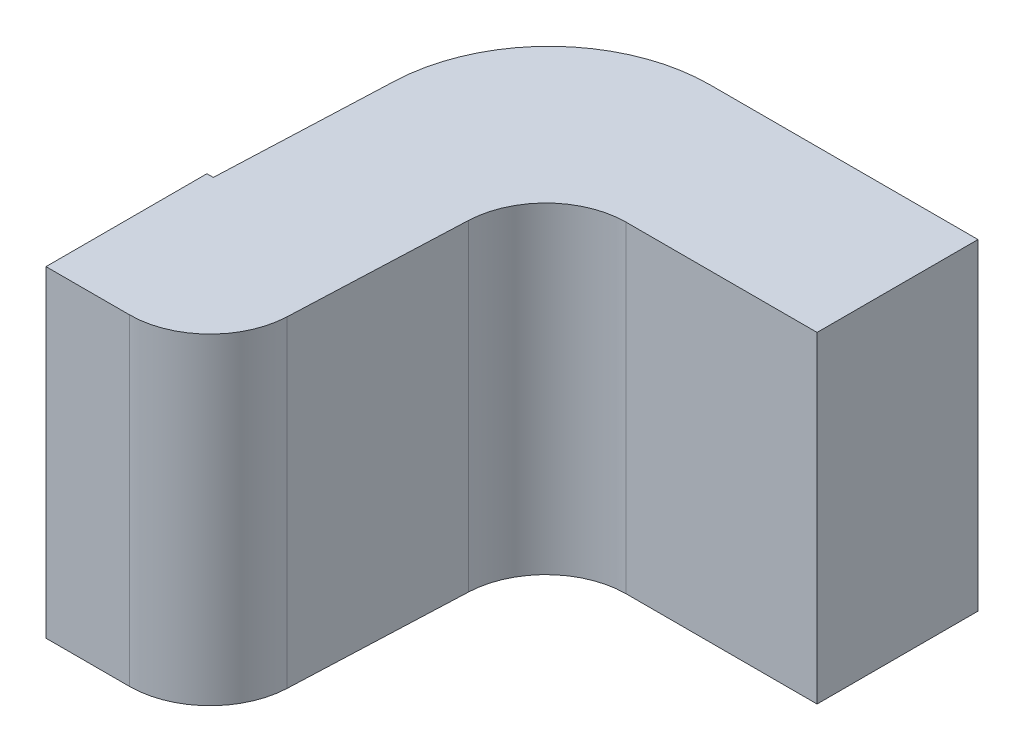
ISO-10303-21;
HEADER;
FILE_DESCRIPTION(('STEP AP214'),'2;1');
FILE_NAME('part.step','',(''),(''),'','','');
FILE_SCHEMA(('AUTOMOTIVE_DESIGN { 1 0 10303 214 1 1 1 1 }'));
ENDSEC;
DATA;
#1=APPLICATION_CONTEXT('core data for automotive mechanical design processes');
#2=APPLICATION_PROTOCOL_DEFINITION('international standard','automotive_design',2000,#1);
#3=PRODUCT_CONTEXT('',#1,'mechanical');
#4=PRODUCT('Part','Part','',(#3));
#5=PRODUCT_RELATED_PRODUCT_CATEGORY('part','',(#4));
#6=PRODUCT_DEFINITION_FORMATION('','',#4);
#7=PRODUCT_DEFINITION_CONTEXT('part definition',#1,'design');
#8=PRODUCT_DEFINITION('design','',#6,#7);
#9=PRODUCT_DEFINITION_SHAPE('','',#8);
#10=(LENGTH_UNIT() NAMED_UNIT(*) SI_UNIT(.MILLI.,.METRE.));
#11=(NAMED_UNIT(*) PLANE_ANGLE_UNIT() SI_UNIT($,.RADIAN.));
#12=(NAMED_UNIT(*) SI_UNIT($,.STERADIAN.) SOLID_ANGLE_UNIT());
#13=UNCERTAINTY_MEASURE_WITH_UNIT(LENGTH_MEASURE(1.E-05),#10,'distance_accuracy_value','');
#14=(GEOMETRIC_REPRESENTATION_CONTEXT(3) GLOBAL_UNCERTAINTY_ASSIGNED_CONTEXT((#13)) GLOBAL_UNIT_ASSIGNED_CONTEXT((#10,
#11,#12)) REPRESENTATION_CONTEXT('',''));
#15=CARTESIAN_POINT('',(0.,0.,0.));
#16=DIRECTION('',(0.,0.,1.));
#17=DIRECTION('',(1.,0.,0.));
#18=AXIS2_PLACEMENT_3D('',#15,#16,#17);
#19=CARTESIAN_POINT('',(0.869222069455,0.2,0.246012646141));
#20=DIRECTION('',(0.,1.,0.));
#21=DIRECTION('',(-1.,0.,0.));
#22=AXIS2_PLACEMENT_3D('',#19,#20,#21);
#23=PLANE('',#22);
#24=DIRECTION('',(1.,0.,0.));
#25=VECTOR('',#24,1.);
#26=CARTESIAN_POINT('',(0.675,0.2,0.2));
#27=LINE('',#26,#25);
#28=CARTESIAN_POINT('',(1.2,0.2,0.2));
#29=VERTEX_POINT('',#28);
#30=CARTESIAN_POINT('',(0.962760303737,0.2,0.2));
#31=VERTEX_POINT('',#30);
#32=EDGE_CURVE('E85',#29,#31,#27,.F.);
#33=ORIENTED_EDGE('',*,*,#32,.F.);
#34=DIRECTION('',(0.,0.,-1.));
#35=VECTOR('',#34,1.);
#36=CARTESIAN_POINT('',(1.2,0.2,0.));
#37=LINE('',#36,#35);
#38=CARTESIAN_POINT('',(1.2,0.2,0.));
#39=VERTEX_POINT('',#38);
#40=EDGE_CURVE('E104',#39,#29,#37,.F.);
#41=ORIENTED_EDGE('',*,*,#40,.F.);
#42=DIRECTION('',(1.,0.,0.));
#43=VECTOR('',#42,1.);
#44=CARTESIAN_POINT('',(0.675,0.2,0.));
#45=LINE('',#44,#43);
#46=CARTESIAN_POINT('',(0.866840202491,0.2,0.));
#47=VERTEX_POINT('',#46);
#48=EDGE_CURVE('E128',#39,#47,#45,.F.);
#49=ORIENTED_EDGE('',*,*,#48,.T.);
#50=CARTESIAN_POINT('',(0.866840202491,0.2,0.2));
#51=DIRECTION('',(0.,1.,0.));
#52=DIRECTION('',(0.,0.,1.));
#53=AXIS2_PLACEMENT_3D('',#50,#51,#52);
#54=CIRCLE('',#53,0.2);
#55=CARTESIAN_POINT('',(0.667013587872555,0.2,0.191673891057771));
#56=VERTEX_POINT('',#55);
#57=EDGE_CURVE('E175',#56,#47,#54,.F.);
#58=ORIENTED_EDGE('',*,*,#57,.F.);
#59=DIRECTION('',(0.0416305447122046,0.,-0.999133073092351));
#60=VECTOR('',#59,1.);
#61=CARTESIAN_POINT('',(0.675,0.2,0.));
#62=LINE('',#61,#60);
#63=CARTESIAN_POINT('',(0.657986412127406,0.2,0.408326108942011));
#64=VERTEX_POINT('',#63);
#65=EDGE_CURVE('E134',#56,#64,#62,.F.);
#66=ORIENTED_EDGE('',*,*,#65,.T.);
#67=DIRECTION('',(1.,0.,0.));
#68=VECTOR('',#67,1.);
#69=CARTESIAN_POINT('',(0.65,0.2,0.408326108942));
#70=LINE('',#69,#68);
#71=CARTESIAN_POINT('',(0.65,0.2,0.408326108942));
#72=VERTEX_POINT('',#71);
#73=EDGE_CURVE('E141',#64,#72,#70,.F.);
#74=ORIENTED_EDGE('',*,*,#73,.T.);
#75=DIRECTION('',(0.,0.,-1.));
#76=VECTOR('',#75,1.);
#77=CARTESIAN_POINT('',(0.65,0.2,0.408326108942));
#78=LINE('',#77,#76);
#79=CARTESIAN_POINT('',(0.65,0.2,0.608326108942));
#80=VERTEX_POINT('',#79);
#81=EDGE_CURVE('E147',#72,#80,#78,.F.);
#82=ORIENTED_EDGE('',*,*,#81,.T.);
#83=DIRECTION('',(1.,0.,0.));
#84=VECTOR('',#83,1.);
#85=CARTESIAN_POINT('',(0.65,0.2,0.608326108942));
#86=LINE('',#85,#84);
#87=CARTESIAN_POINT('',(0.753906513373,0.2,0.608326108942));
#88=VERTEX_POINT('',#87);
#89=EDGE_CURVE('E153',#88,#80,#86,.F.);
#90=ORIENTED_EDGE('',*,*,#89,.F.);
#91=CARTESIAN_POINT('',(0.753906513373,0.2,0.508326108942));
#92=DIRECTION('',(0.,1.,0.));
#93=DIRECTION('',(0.,0.,1.));
#94=AXIS2_PLACEMENT_3D('',#91,#92,#93);
#95=CIRCLE('',#94,0.1);
#96=CARTESIAN_POINT('',(0.853819820681954,0.2,0.512489163413604));
#97=VERTEX_POINT('',#96);
#98=EDGE_CURVE('E156',#97,#88,#95,.F.);
#99=ORIENTED_EDGE('',*,*,#98,.F.);
#100=DIRECTION('',(0.0416305447122046,0.,-0.999133073092351));
#101=VECTOR('',#100,1.);
#102=CARTESIAN_POINT('',(0.874826614618,0.2,0.008326108942436));
#103=LINE('',#102,#101);
#104=CARTESIAN_POINT('',(0.862846996426892,0.2,0.295836945528869));
#105=VERTEX_POINT('',#104);
#106=EDGE_CURVE('E159',#105,#97,#103,.F.);
#107=ORIENTED_EDGE('',*,*,#106,.F.);
#108=CARTESIAN_POINT('',(0.962760303737,0.2,0.3));
#109=DIRECTION('',(0.,1.,0.));
#110=DIRECTION('',(0.,0.,1.));
#111=AXIS2_PLACEMENT_3D('',#108,#109,#110);
#112=CIRCLE('',#111,0.1);
#113=EDGE_CURVE('E19',#105,#31,#112,.F.);
#114=ORIENTED_EDGE('',*,*,#113,.T.);
#115=EDGE_LOOP('',(#33,#41,#49,#58,#66,#74,#82,#90,#99,#107,#114));
#116=FACE_BOUND('',#115,.T.);
#117=ADVANCED_FACE('F16',(#116),#23,.T.);
#118=CARTESIAN_POINT('',(0.675,-0.2,0.));
#119=DIRECTION('',(0.,0.,1.));
#120=DIRECTION('',(1.,0.,0.));
#121=AXIS2_PLACEMENT_3D('',#118,#119,#120);
#122=PLANE('',#121);
#123=ORIENTED_EDGE('',*,*,#48,.F.);
#124=DIRECTION('',(0.,1.,0.));
#125=VECTOR('',#124,1.);
#126=CARTESIAN_POINT('',(1.2,-0.2,0.));
#127=LINE('',#126,#125);
#128=CARTESIAN_POINT('',(1.2,-0.2,0.));
#129=VERTEX_POINT('',#128);
#130=EDGE_CURVE('E93',#129,#39,#127,.T.);
#131=ORIENTED_EDGE('',*,*,#130,.F.);
#132=DIRECTION('',(1.,0.,0.));
#133=VECTOR('',#132,1.);
#134=CARTESIAN_POINT('',(0.869222069455,-0.2,0.));
#135=LINE('',#134,#133);
#136=CARTESIAN_POINT('',(0.866840202491,-0.2,0.));
#137=VERTEX_POINT('',#136);
#138=EDGE_CURVE('E118',#137,#129,#135,.T.);
#139=ORIENTED_EDGE('',*,*,#138,.F.);
#140=DIRECTION('',(0.,1.,0.));
#141=VECTOR('',#140,1.);
#142=CARTESIAN_POINT('',(0.866840202491,-0.2,0.));
#143=LINE('',#142,#141);
#144=EDGE_CURVE('E120',#47,#137,#143,.F.);
#145=ORIENTED_EDGE('',*,*,#144,.F.);
#146=EDGE_LOOP('',(#123,#131,#139,#145));
#147=FACE_BOUND('',#146,.T.);
#148=ADVANCED_FACE('F253',(#147),#122,.F.);
#149=CARTESIAN_POINT('',(1.2,-0.2,0.));
#150=DIRECTION('',(1.,0.,0.));
#151=DIRECTION('',(0.,0.,-1.));
#152=AXIS2_PLACEMENT_3D('',#149,#150,#151);
#153=PLANE('',#152);
#154=ORIENTED_EDGE('',*,*,#40,.T.);
#155=DIRECTION('',(0.,1.,0.));
#156=VECTOR('',#155,1.);
#157=CARTESIAN_POINT('',(1.2,-0.2,0.2));
#158=LINE('',#157,#156);
#159=CARTESIAN_POINT('',(1.2,-0.2,0.2));
#160=VERTEX_POINT('',#159);
#161=EDGE_CURVE('E98',#160,#29,#158,.T.);
#162=ORIENTED_EDGE('',*,*,#161,.F.);
#163=DIRECTION('',(0.,0.,-1.));
#164=VECTOR('',#163,1.);
#165=CARTESIAN_POINT('',(1.2,-0.2,0.246012646141));
#166=LINE('',#165,#164);
#167=EDGE_CURVE('E102',#129,#160,#166,.F.);
#168=ORIENTED_EDGE('',*,*,#167,.F.);
#169=ORIENTED_EDGE('',*,*,#130,.T.);
#170=EDGE_LOOP('',(#154,#162,#168,#169));
#171=FACE_BOUND('',#170,.T.);
#172=ADVANCED_FACE('F100',(#171),#153,.T.);
#173=CARTESIAN_POINT('',(0.675,-0.2,0.2));
#174=DIRECTION('',(0.,0.,1.));
#175=DIRECTION('',(1.,0.,0.));
#176=AXIS2_PLACEMENT_3D('',#173,#174,#175);
#177=PLANE('',#176);
#178=DIRECTION('',(1.,0.,0.));
#179=VECTOR('',#178,1.);
#180=CARTESIAN_POINT('',(0.869222069455,-0.2,0.2));
#181=LINE('',#180,#179);
#182=CARTESIAN_POINT('',(0.962760303737,-0.2,0.2));
#183=VERTEX_POINT('',#182);
#184=EDGE_CURVE('E108',#160,#183,#181,.F.);
#185=ORIENTED_EDGE('',*,*,#184,.F.);
#186=ORIENTED_EDGE('',*,*,#161,.T.);
#187=ORIENTED_EDGE('',*,*,#32,.T.);
#188=DIRECTION('',(0.,1.,0.));
#189=VECTOR('',#188,1.);
#190=CARTESIAN_POINT('',(0.962760303737,-0.2,0.2));
#191=LINE('',#190,#189);
#192=EDGE_CURVE('E110',#31,#183,#191,.F.);
#193=ORIENTED_EDGE('',*,*,#192,.T.);
#194=EDGE_LOOP('',(#185,#186,#187,#193));
#195=FACE_BOUND('',#194,.T.);
#196=ADVANCED_FACE('F109',(#195),#177,.T.);
#197=CARTESIAN_POINT('',(0.962760303737,-0.2,0.3));
#198=DIRECTION('',(0.,1.,0.));
#199=DIRECTION('',(0.,0.,1.));
#200=AXIS2_PLACEMENT_3D('',#197,#198,#199);
#201=CYLINDRICAL_SURFACE('',#200,0.1);
#202=ORIENTED_EDGE('',*,*,#113,.F.);
#203=DIRECTION('',(0.,1.,0.));
#204=VECTOR('',#203,1.);
#205=CARTESIAN_POINT('',(0.862846996426887,-0.2,0.295836945528995));
#206=LINE('',#205,#204);
#207=CARTESIAN_POINT('',(0.862846996426947,-0.2,0.295836945528921));
#208=VERTEX_POINT('',#207);
#209=EDGE_CURVE('E162',#208,#105,#206,.T.);
#210=ORIENTED_EDGE('',*,*,#209,.F.);
#211=CARTESIAN_POINT('',(0.962760303737,-0.2,0.3));
#212=DIRECTION('',(0.,1.,0.));
#213=DIRECTION('',(0.,0.,1.));
#214=AXIS2_PLACEMENT_3D('',#211,#212,#213);
#215=CIRCLE('',#214,0.1);
#216=EDGE_CURVE('E114',#183,#208,#215,.T.);
#217=ORIENTED_EDGE('',*,*,#216,.F.);
#218=ORIENTED_EDGE('',*,*,#192,.F.);
#219=EDGE_LOOP('',(#202,#210,#217,#218));
#220=FACE_BOUND('',#219,.T.);
#221=ADVANCED_FACE('F193',(#220),#201,.F.);
#222=CARTESIAN_POINT('',(0.874826614618,-0.2,0.008326108942436));
#223=DIRECTION('',(0.999133073092351,0.,0.0416305447122046));
#224=DIRECTION('',(0.0416305447122046,0.,-0.999133073092351));
#225=AXIS2_PLACEMENT_3D('',#222,#223,#224);
#226=PLANE('',#225);
#227=ORIENTED_EDGE('',*,*,#106,.T.);
#228=DIRECTION('',(0.,1.,0.));
#229=VECTOR('',#228,1.);
#230=CARTESIAN_POINT('',(0.853819820682202,-0.2,0.512489163414008));
#231=LINE('',#230,#229);
#232=CARTESIAN_POINT('',(0.853819820682119,-0.2,0.512489163413561));
#233=VERTEX_POINT('',#232);
#234=EDGE_CURVE('E161',#233,#97,#231,.T.);
#235=ORIENTED_EDGE('',*,*,#234,.F.);
#236=DIRECTION('',(-0.0416305447112224,0.,0.999133073092392));
#237=VECTOR('',#236,1.);
#238=CARTESIAN_POINT('',(0.862846996427,-0.2,0.295836945529));
#239=LINE('',#238,#237);
#240=EDGE_CURVE('E173',#208,#233,#239,.T.);
#241=ORIENTED_EDGE('',*,*,#240,.F.);
#242=ORIENTED_EDGE('',*,*,#209,.T.);
#243=EDGE_LOOP('',(#227,#235,#241,#242));
#244=FACE_BOUND('',#243,.T.);
#245=ADVANCED_FACE('F191',(#244),#226,.T.);
#246=CARTESIAN_POINT('',(0.753906513373,-0.2,0.508326108942));
#247=DIRECTION('',(0.,1.,0.));
#248=DIRECTION('',(0.,0.,1.));
#249=AXIS2_PLACEMENT_3D('',#246,#247,#248);
#250=CYLINDRICAL_SURFACE('',#249,0.1);
#251=DIRECTION('',(0.,1.,0.));
#252=VECTOR('',#251,1.);
#253=CARTESIAN_POINT('',(0.753906513373,-0.2,0.608326108942));
#254=LINE('',#253,#252);
#255=CARTESIAN_POINT('',(0.753906513373,-0.2,0.608326108942));
#256=VERTEX_POINT('',#255);
#257=EDGE_CURVE('E150',#256,#88,#254,.T.);
#258=ORIENTED_EDGE('',*,*,#257,.F.);
#259=CARTESIAN_POINT('',(0.753906513373,-0.2,0.508326108942));
#260=DIRECTION('',(0.,1.,0.));
#261=DIRECTION('',(0.,0.,1.));
#262=AXIS2_PLACEMENT_3D('',#259,#260,#261);
#263=CIRCLE('',#262,0.1);
#264=EDGE_CURVE('E169',#233,#256,#263,.F.);
#265=ORIENTED_EDGE('',*,*,#264,.F.);
#266=ORIENTED_EDGE('',*,*,#234,.T.);
#267=ORIENTED_EDGE('',*,*,#98,.T.);
#268=EDGE_LOOP('',(#258,#265,#266,#267));
#269=FACE_BOUND('',#268,.T.);
#270=ADVANCED_FACE('F276',(#269),#250,.T.);
#271=CARTESIAN_POINT('',(0.65,-0.2,0.608326108942));
#272=DIRECTION('',(0.,0.,1.));
#273=DIRECTION('',(1.,0.,0.));
#274=AXIS2_PLACEMENT_3D('',#271,#272,#273);
#275=PLANE('',#274);
#276=DIRECTION('',(1.,0.,0.));
#277=VECTOR('',#276,1.);
#278=CARTESIAN_POINT('',(0.869222069455,-0.2,0.608326108942));
#279=LINE('',#278,#277);
#280=CARTESIAN_POINT('',(0.65,-0.2,0.608326108942));
#281=VERTEX_POINT('',#280);
#282=EDGE_CURVE('E172',#256,#281,#279,.F.);
#283=ORIENTED_EDGE('',*,*,#282,.F.);
#284=ORIENTED_EDGE('',*,*,#257,.T.);
#285=ORIENTED_EDGE('',*,*,#89,.T.);
#286=DIRECTION('',(0.,1.,0.));
#287=VECTOR('',#286,1.);
#288=CARTESIAN_POINT('',(0.65,-0.2,0.608326108942));
#289=LINE('',#288,#287);
#290=EDGE_CURVE('E144',#80,#281,#289,.F.);
#291=ORIENTED_EDGE('',*,*,#290,.T.);
#292=EDGE_LOOP('',(#283,#284,#285,#291));
#293=FACE_BOUND('',#292,.T.);
#294=ADVANCED_FACE('F230',(#293),#275,.T.);
#295=CARTESIAN_POINT('',(0.65,-0.2,0.408326108942));
#296=DIRECTION('',(1.,0.,0.));
#297=DIRECTION('',(0.,0.,-1.));
#298=AXIS2_PLACEMENT_3D('',#295,#296,#297);
#299=PLANE('',#298);
#300=ORIENTED_EDGE('',*,*,#290,.F.);
#301=ORIENTED_EDGE('',*,*,#81,.F.);
#302=DIRECTION('',(0.,1.,0.));
#303=VECTOR('',#302,1.);
#304=CARTESIAN_POINT('',(0.65,-0.2,0.408326108942));
#305=LINE('',#304,#303);
#306=CARTESIAN_POINT('',(0.65,-0.2,0.408326108942));
#307=VERTEX_POINT('',#306);
#308=EDGE_CURVE('E138',#72,#307,#305,.F.);
#309=ORIENTED_EDGE('',*,*,#308,.T.);
#310=DIRECTION('',(0.,0.,-1.));
#311=VECTOR('',#310,1.);
#312=CARTESIAN_POINT('',(0.65,-0.2,0.246012646141));
#313=LINE('',#312,#311);
#314=EDGE_CURVE('E213',#281,#307,#313,.T.);
#315=ORIENTED_EDGE('',*,*,#314,.F.);
#316=EDGE_LOOP('',(#300,#301,#309,#315));
#317=FACE_BOUND('',#316,.T.);
#318=ADVANCED_FACE('F234',(#317),#299,.F.);
#319=CARTESIAN_POINT('',(0.65,-0.2,0.408326108942));
#320=DIRECTION('',(0.,0.,1.));
#321=DIRECTION('',(1.,0.,0.));
#322=AXIS2_PLACEMENT_3D('',#319,#320,#321);
#323=PLANE('',#322);
#324=DIRECTION('',(1.,0.,0.));
#325=VECTOR('',#324,1.);
#326=CARTESIAN_POINT('',(0.869222069455,-0.2,0.408326108942));
#327=LINE('',#326,#325);
#328=CARTESIAN_POINT('',(0.657986412127135,-0.2,0.408326108942006));
#329=VERTEX_POINT('',#328);
#330=EDGE_CURVE('E210',#307,#329,#327,.T.);
#331=ORIENTED_EDGE('',*,*,#330,.F.);
#332=ORIENTED_EDGE('',*,*,#308,.F.);
#333=ORIENTED_EDGE('',*,*,#73,.F.);
#334=DIRECTION('',(0.,1.,0.));
#335=VECTOR('',#334,1.);
#336=CARTESIAN_POINT('',(0.657986412127406,-0.2,0.408326108942017));
#337=LINE('',#336,#335);
#338=EDGE_CURVE('E137',#64,#329,#337,.F.);
#339=ORIENTED_EDGE('',*,*,#338,.T.);
#340=EDGE_LOOP('',(#331,#332,#333,#339));
#341=FACE_BOUND('',#340,.T.);
#342=ADVANCED_FACE('F247',(#341),#323,.F.);
#343=CARTESIAN_POINT('',(0.675,-0.2,0.));
#344=DIRECTION('',(0.999133073092351,0.,0.0416305447122046));
#345=DIRECTION('',(0.0416305447122046,0.,-0.999133073092351));
#346=AXIS2_PLACEMENT_3D('',#343,#344,#345);
#347=PLANE('',#346);
#348=ORIENTED_EDGE('',*,*,#65,.F.);
#349=DIRECTION('',(0.,1.,0.));
#350=VECTOR('',#349,1.);
#351=CARTESIAN_POINT('',(0.667013587872512,-0.2,0.19167389105798));
#352=LINE('',#351,#350);
#353=CARTESIAN_POINT('',(0.667013587872781,-0.2,0.191673891057398));
#354=VERTEX_POINT('',#353);
#355=EDGE_CURVE('E34',#354,#56,#352,.T.);
#356=ORIENTED_EDGE('',*,*,#355,.F.);
#357=DIRECTION('',(0.0416305447160177,0.,-0.999133073092192));
#358=VECTOR('',#357,1.);
#359=CARTESIAN_POINT('',(0.657986412127,-0.2,0.408326108942));
#360=LINE('',#359,#358);
#361=EDGE_CURVE('E25',#329,#354,#360,.T.);
#362=ORIENTED_EDGE('',*,*,#361,.F.);
#363=ORIENTED_EDGE('',*,*,#338,.F.);
#364=EDGE_LOOP('',(#348,#356,#362,#363));
#365=FACE_BOUND('',#364,.T.);
#366=ADVANCED_FACE('F241',(#365),#347,.F.);
#367=CARTESIAN_POINT('',(0.866840202491,-0.2,0.2));
#368=DIRECTION('',(0.,1.,0.));
#369=DIRECTION('',(0.,0.,1.));
#370=AXIS2_PLACEMENT_3D('',#367,#368,#369);
#371=CYLINDRICAL_SURFACE('',#370,0.2);
#372=ORIENTED_EDGE('',*,*,#57,.T.);
#373=ORIENTED_EDGE('',*,*,#144,.T.);
#374=CARTESIAN_POINT('',(0.866840202491,-0.2,0.2));
#375=DIRECTION('',(0.,1.,0.));
#376=DIRECTION('',(0.,0.,1.));
#377=AXIS2_PLACEMENT_3D('',#374,#375,#376);
#378=CIRCLE('',#377,0.2);
#379=EDGE_CURVE('E11',#354,#137,#378,.F.);
#380=ORIENTED_EDGE('',*,*,#379,.F.);
#381=ORIENTED_EDGE('',*,*,#355,.T.);
#382=EDGE_LOOP('',(#372,#373,#380,#381));
#383=FACE_BOUND('',#382,.T.);
#384=ADVANCED_FACE('F252',(#383),#371,.T.);
#385=CARTESIAN_POINT('',(0.869222069455,-0.2,0.246012646141));
#386=DIRECTION('',(0.,-1.,0.));
#387=DIRECTION('',(0.,0.,-1.));
#388=AXIS2_PLACEMENT_3D('',#385,#386,#387);
#389=PLANE('',#388);
#390=ORIENTED_EDGE('',*,*,#361,.T.);
#391=ORIENTED_EDGE('',*,*,#379,.T.);
#392=ORIENTED_EDGE('',*,*,#138,.T.);
#393=ORIENTED_EDGE('',*,*,#167,.T.);
#394=ORIENTED_EDGE('',*,*,#184,.T.);
#395=ORIENTED_EDGE('',*,*,#216,.T.);
#396=ORIENTED_EDGE('',*,*,#240,.T.);
#397=ORIENTED_EDGE('',*,*,#264,.T.);
#398=ORIENTED_EDGE('',*,*,#282,.T.);
#399=ORIENTED_EDGE('',*,*,#314,.T.);
#400=ORIENTED_EDGE('',*,*,#330,.T.);
#401=EDGE_LOOP('',(#390,#391,#392,#393,#394,#395,#396,#397,#398,#399,#400));
#402=FACE_BOUND('',#401,.T.);
#403=ADVANCED_FACE('F117',(#402),#389,.T.);
#404=CLOSED_SHELL('',(#117,#148,#172,#196,#221,#245,#270,#294,#318,#342,#366,#384,#403));
#405=MANIFOLD_SOLID_BREP('B1',#404);
#406=ADVANCED_BREP_SHAPE_REPRESENTATION('',(#18,#405),#14);
#407=SHAPE_DEFINITION_REPRESENTATION(#9,#406);
ENDSEC;
END-ISO-10303-21;
